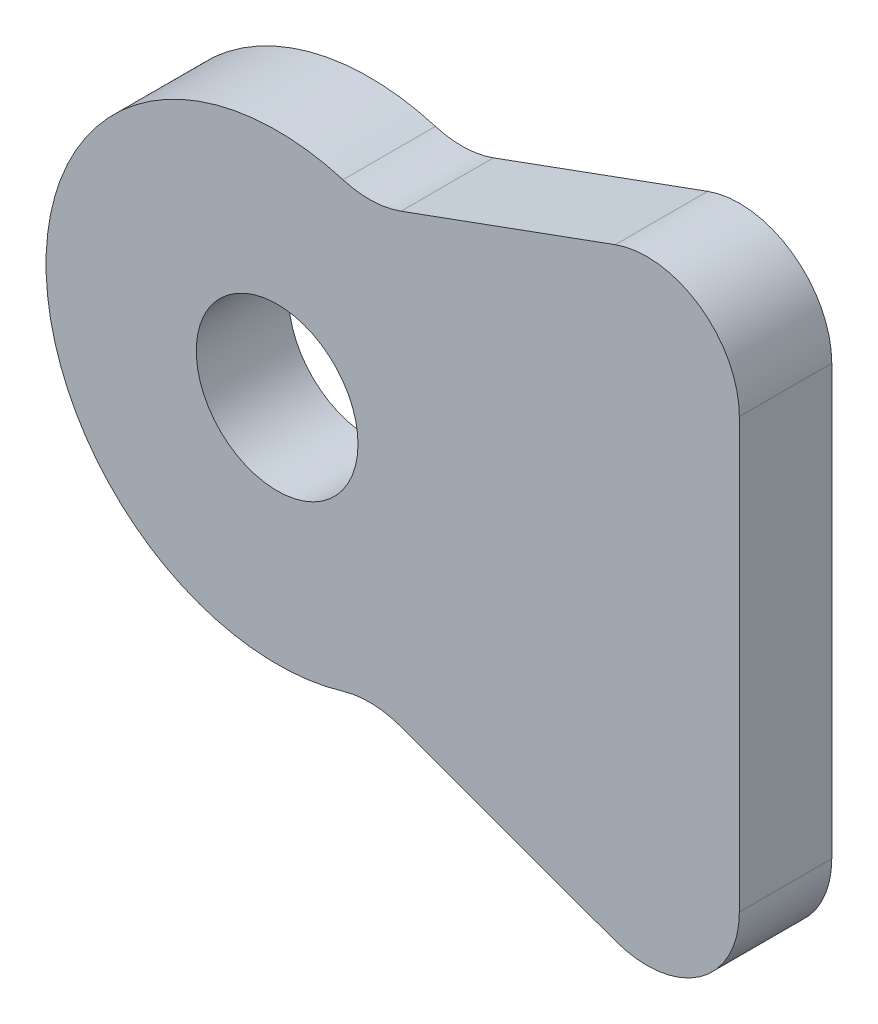
ISO-10303-21;
HEADER;
FILE_DESCRIPTION(('STEP AP214'),'2;1');
FILE_NAME('part.step','',(''),(''),'','','');
FILE_SCHEMA(('AUTOMOTIVE_DESIGN { 1 0 10303 214 1 1 1 1 }'));
ENDSEC;
DATA;
#1=APPLICATION_CONTEXT('core data for automotive mechanical design processes');
#2=APPLICATION_PROTOCOL_DEFINITION('international standard','automotive_design',2000,#1);
#3=PRODUCT_CONTEXT('',#1,'mechanical');
#4=PRODUCT('Part','Part','',(#3));
#5=PRODUCT_RELATED_PRODUCT_CATEGORY('part','',(#4));
#6=PRODUCT_DEFINITION_FORMATION('','',#4);
#7=PRODUCT_DEFINITION_CONTEXT('part definition',#1,'design');
#8=PRODUCT_DEFINITION('design','',#6,#7);
#9=PRODUCT_DEFINITION_SHAPE('','',#8);
#10=(LENGTH_UNIT() NAMED_UNIT(*) SI_UNIT(.MILLI.,.METRE.));
#11=(NAMED_UNIT(*) PLANE_ANGLE_UNIT() SI_UNIT($,.RADIAN.));
#12=(NAMED_UNIT(*) SI_UNIT($,.STERADIAN.) SOLID_ANGLE_UNIT());
#13=UNCERTAINTY_MEASURE_WITH_UNIT(LENGTH_MEASURE(1.E-05),#10,'distance_accuracy_value','');
#14=(GEOMETRIC_REPRESENTATION_CONTEXT(3) GLOBAL_UNCERTAINTY_ASSIGNED_CONTEXT((#13)) GLOBAL_UNIT_ASSIGNED_CONTEXT((#10,
#11,#12)) REPRESENTATION_CONTEXT('',''));
#15=CARTESIAN_POINT('',(0.,0.,0.));
#16=DIRECTION('',(0.,0.,1.));
#17=DIRECTION('',(1.,0.,0.));
#18=AXIS2_PLACEMENT_3D('',#15,#16,#17);
#19=CARTESIAN_POINT('',(0.,0.,2.));
#20=DIRECTION('',(0.,0.,1.));
#21=DIRECTION('',(1.,0.,0.));
#22=AXIS2_PLACEMENT_3D('',#19,#20,#21);
#23=PLANE('',#22);
#24=DIRECTION('',(0.939478721163946,-0.342607256899437,0.));
#25=VECTOR('',#24,1.);
#26=CARTESIAN_POINT('',(10.,-7.5,2.));
#27=LINE('',#26,#25);
#28=CARTESIAN_POINT('',(2.6803658446033,-4.83069017637678,2.));
#29=VERTEX_POINT('',#28);
#30=CARTESIAN_POINT('',(7.31478548620112,-6.52076123914823,2.));
#31=VERTEX_POINT('',#30);
#32=EDGE_CURVE('E159',#29,#31,#27,.T.);
#33=ORIENTED_EDGE('',*,*,#32,.T.);
#34=CARTESIAN_POINT('',(8.,-4.64180379682034,2.));
#35=DIRECTION('',(0.,0.,1.));
#36=DIRECTION('',(1.,0.,0.));
#37=AXIS2_PLACEMENT_3D('',#34,#35,#36);
#38=CIRCLE('',#37,2.);
#39=CARTESIAN_POINT('',(10.,-4.64180379682034,2.));
#40=VERTEX_POINT('',#39);
#41=EDGE_CURVE('E137',#31,#40,#38,.T.);
#42=ORIENTED_EDGE('',*,*,#41,.T.);
#43=DIRECTION('',(0.,1.,0.));
#44=VECTOR('',#43,1.);
#45=CARTESIAN_POINT('',(10.,7.5,2.));
#46=LINE('',#45,#44);
#47=CARTESIAN_POINT('',(10.,4.64180379682034,2.));
#48=VERTEX_POINT('',#47);
#49=EDGE_CURVE('E163',#40,#48,#46,.T.);
#50=ORIENTED_EDGE('',*,*,#49,.T.);
#51=CARTESIAN_POINT('',(8.,4.64180379682034,2.));
#52=DIRECTION('',(0.,0.,1.));
#53=DIRECTION('',(1.,0.,0.));
#54=AXIS2_PLACEMENT_3D('',#51,#52,#53);
#55=CIRCLE('',#54,2.);
#56=CARTESIAN_POINT('',(7.31478548620112,6.52076123914823,2.));
#57=VERTEX_POINT('',#56);
#58=EDGE_CURVE('E135',#48,#57,#55,.T.);
#59=ORIENTED_EDGE('',*,*,#58,.T.);
#60=DIRECTION('',(-0.939478721163946,-0.342607256899437,0.));
#61=VECTOR('',#60,1.);
#62=CARTESIAN_POINT('',(10.,7.5,2.));
#63=LINE('',#62,#61);
#64=CARTESIAN_POINT('',(2.6803658446033,4.83069017637678,2.));
#65=VERTEX_POINT('',#64);
#66=EDGE_CURVE('E104',#57,#65,#63,.T.);
#67=ORIENTED_EDGE('',*,*,#66,.T.);
#68=CARTESIAN_POINT('',(1.99515133080442,6.70964761870468,2.));
#69=DIRECTION('',(0.,0.,1.));
#70=DIRECTION('',(1.,0.,0.));
#71=AXIS2_PLACEMENT_3D('',#68,#69,#70);
#72=CIRCLE('',#71,2.);
#73=CARTESIAN_POINT('',(1.42510809343173,4.79260544193191,2.));
#74=VERTEX_POINT('',#73);
#75=EDGE_CURVE('E41',#65,#74,#72,.F.);
#76=ORIENTED_EDGE('',*,*,#75,.T.);
#77=CARTESIAN_POINT('',(0.,0.,2.));
#78=DIRECTION('',(0.,0.,1.));
#79=DIRECTION('',(1.,0.,0.));
#80=AXIS2_PLACEMENT_3D('',#77,#78,#79);
#81=CIRCLE('',#80,5.);
#82=CARTESIAN_POINT('',(1.42510809343173,-4.79260544193191,2.));
#83=VERTEX_POINT('',#82);
#84=EDGE_CURVE('E102',#74,#83,#81,.T.);
#85=ORIENTED_EDGE('',*,*,#84,.T.);
#86=CARTESIAN_POINT('',(1.99515133080442,-6.70964761870468,2.));
#87=DIRECTION('',(0.,0.,1.));
#88=DIRECTION('',(1.,0.,0.));
#89=AXIS2_PLACEMENT_3D('',#86,#87,#88);
#90=CIRCLE('',#89,2.);
#91=EDGE_CURVE('E146',#83,#29,#90,.F.);
#92=ORIENTED_EDGE('',*,*,#91,.T.);
#93=EDGE_LOOP('',(#33,#42,#50,#59,#67,#76,#85,#92));
#94=FACE_BOUND('',#93,.T.);
#95=CARTESIAN_POINT('',(0.,0.,2.));
#96=DIRECTION('',(0.,0.,1.));
#97=DIRECTION('',(1.,0.,0.));
#98=AXIS2_PLACEMENT_3D('',#95,#96,#97);
#99=CIRCLE('',#98,1.75);
#100=CARTESIAN_POINT('',(1.75,0.,2.));
#101=VERTEX_POINT('',#100);
#102=EDGE_CURVE('E156',#101,#101,#99,.T.);
#103=ORIENTED_EDGE('',*,*,#102,.F.);
#104=EDGE_LOOP('',(#103));
#105=FACE_BOUND('',#104,.T.);
#106=ADVANCED_FACE('F33',(#94,#105),#23,.T.);
#107=CARTESIAN_POINT('',(0.,0.,0.));
#108=DIRECTION('',(0.,0.,1.));
#109=DIRECTION('',(1.,0.,0.));
#110=AXIS2_PLACEMENT_3D('',#107,#108,#109);
#111=PLANE('',#110);
#112=DIRECTION('',(0.,1.,0.));
#113=VECTOR('',#112,1.);
#114=CARTESIAN_POINT('',(10.,7.5,0.));
#115=LINE('',#114,#113);
#116=CARTESIAN_POINT('',(10.,-4.64180379682034,0.));
#117=VERTEX_POINT('',#116);
#118=CARTESIAN_POINT('',(10.,4.64180379682034,0.));
#119=VERTEX_POINT('',#118);
#120=EDGE_CURVE('E175',#117,#119,#115,.T.);
#121=ORIENTED_EDGE('',*,*,#120,.F.);
#122=CARTESIAN_POINT('',(8.,-4.64180379682034,0.));
#123=DIRECTION('',(0.,0.,1.));
#124=DIRECTION('',(1.,0.,0.));
#125=AXIS2_PLACEMENT_3D('',#122,#123,#124);
#126=CIRCLE('',#125,2.);
#127=CARTESIAN_POINT('',(7.31478548620112,-6.52076123914823,0.));
#128=VERTEX_POINT('',#127);
#129=EDGE_CURVE('E144',#117,#128,#126,.F.);
#130=ORIENTED_EDGE('',*,*,#129,.T.);
#131=DIRECTION('',(0.939478721163946,-0.342607256899437,0.));
#132=VECTOR('',#131,1.);
#133=CARTESIAN_POINT('',(10.,-7.5,0.));
#134=LINE('',#133,#132);
#135=CARTESIAN_POINT('',(2.6803658446033,-4.83069017637678,0.));
#136=VERTEX_POINT('',#135);
#137=EDGE_CURVE('E153',#136,#128,#134,.T.);
#138=ORIENTED_EDGE('',*,*,#137,.F.);
#139=CARTESIAN_POINT('',(1.99515133080442,-6.70964761870468,0.));
#140=DIRECTION('',(0.,0.,1.));
#141=DIRECTION('',(1.,0.,0.));
#142=AXIS2_PLACEMENT_3D('',#139,#140,#141);
#143=CIRCLE('',#142,2.);
#144=CARTESIAN_POINT('',(1.42510809343173,-4.79260544193191,0.));
#145=VERTEX_POINT('',#144);
#146=EDGE_CURVE('E109',#136,#145,#143,.T.);
#147=ORIENTED_EDGE('',*,*,#146,.T.);
#148=CARTESIAN_POINT('',(0.,0.,0.));
#149=DIRECTION('',(0.,0.,1.));
#150=DIRECTION('',(1.,0.,0.));
#151=AXIS2_PLACEMENT_3D('',#148,#149,#150);
#152=CIRCLE('',#151,5.);
#153=CARTESIAN_POINT('',(1.42510809343173,4.79260544193191,0.));
#154=VERTEX_POINT('',#153);
#155=EDGE_CURVE('E118',#154,#145,#152,.T.);
#156=ORIENTED_EDGE('',*,*,#155,.F.);
#157=CARTESIAN_POINT('',(1.99515133080442,6.70964761870468,0.));
#158=DIRECTION('',(0.,0.,1.));
#159=DIRECTION('',(1.,0.,0.));
#160=AXIS2_PLACEMENT_3D('',#157,#158,#159);
#161=CIRCLE('',#160,2.);
#162=CARTESIAN_POINT('',(2.6803658446033,4.83069017637678,0.));
#163=VERTEX_POINT('',#162);
#164=EDGE_CURVE('E11',#154,#163,#161,.T.);
#165=ORIENTED_EDGE('',*,*,#164,.T.);
#166=DIRECTION('',(-0.939478721163946,-0.342607256899437,0.));
#167=VECTOR('',#166,1.);
#168=CARTESIAN_POINT('',(10.,7.5,0.));
#169=LINE('',#168,#167);
#170=CARTESIAN_POINT('',(7.31478548620112,6.52076123914823,0.));
#171=VERTEX_POINT('',#170);
#172=EDGE_CURVE('E166',#171,#163,#169,.T.);
#173=ORIENTED_EDGE('',*,*,#172,.F.);
#174=CARTESIAN_POINT('',(8.,4.64180379682034,0.));
#175=DIRECTION('',(0.,0.,1.));
#176=DIRECTION('',(1.,0.,0.));
#177=AXIS2_PLACEMENT_3D('',#174,#175,#176);
#178=CIRCLE('',#177,2.);
#179=EDGE_CURVE('E48',#171,#119,#178,.F.);
#180=ORIENTED_EDGE('',*,*,#179,.T.);
#181=EDGE_LOOP('',(#121,#130,#138,#147,#156,#165,#173,#180));
#182=FACE_BOUND('',#181,.T.);
#183=CARTESIAN_POINT('',(0.,0.,0.));
#184=DIRECTION('',(0.,0.,1.));
#185=DIRECTION('',(1.,0.,0.));
#186=AXIS2_PLACEMENT_3D('',#183,#184,#185);
#187=CIRCLE('',#186,1.75);
#188=CARTESIAN_POINT('',(1.75,0.,0.));
#189=VERTEX_POINT('',#188);
#190=EDGE_CURVE('E173',#189,#189,#187,.T.);
#191=ORIENTED_EDGE('',*,*,#190,.T.);
#192=EDGE_LOOP('',(#191));
#193=FACE_BOUND('',#192,.T.);
#194=ADVANCED_FACE('F150',(#182,#193),#111,.F.);
#195=CARTESIAN_POINT('',(0.,0.,2.));
#196=DIRECTION('',(0.,0.,-1.));
#197=DIRECTION('',(-1.,0.,0.));
#198=AXIS2_PLACEMENT_3D('',#195,#196,#197);
#199=CYLINDRICAL_SURFACE('',#198,5.);
#200=ORIENTED_EDGE('',*,*,#155,.T.);
#201=DIRECTION('',(0.,0.,-1.));
#202=VECTOR('',#201,1.);
#203=CARTESIAN_POINT('',(1.42510809343173,-4.79260544193191,2.));
#204=LINE('',#203,#202);
#205=EDGE_CURVE('E117',#145,#83,#204,.F.);
#206=ORIENTED_EDGE('',*,*,#205,.T.);
#207=ORIENTED_EDGE('',*,*,#84,.F.);
#208=DIRECTION('',(0.,0.,-1.));
#209=VECTOR('',#208,1.);
#210=CARTESIAN_POINT('',(1.42510809343173,4.79260544193191,2.));
#211=LINE('',#210,#209);
#212=EDGE_CURVE('E114',#74,#154,#211,.T.);
#213=ORIENTED_EDGE('',*,*,#212,.T.);
#214=EDGE_LOOP('',(#200,#206,#207,#213));
#215=FACE_BOUND('',#214,.T.);
#216=ADVANCED_FACE('F113',(#215),#199,.T.);
#217=CARTESIAN_POINT('',(0.,0.,2.));
#218=DIRECTION('',(0.,0.,-1.));
#219=DIRECTION('',(-1.,0.,0.));
#220=AXIS2_PLACEMENT_3D('',#217,#218,#219);
#221=CYLINDRICAL_SURFACE('',#220,1.75);
#222=ORIENTED_EDGE('',*,*,#102,.T.);
#223=EDGE_LOOP('',(#222));
#224=FACE_BOUND('',#223,.T.);
#225=ORIENTED_EDGE('',*,*,#190,.F.);
#226=EDGE_LOOP('',(#225));
#227=FACE_BOUND('',#226,.T.);
#228=ADVANCED_FACE('F202',(#224,#227),#221,.F.);
#229=CARTESIAN_POINT('',(10.,7.5,0.));
#230=DIRECTION('',(-0.342607256899437,0.939478721163946,0.));
#231=DIRECTION('',(-0.939478721163946,-0.342607256899437,0.));
#232=AXIS2_PLACEMENT_3D('',#229,#230,#231);
#233=PLANE('',#232);
#234=ORIENTED_EDGE('',*,*,#172,.T.);
#235=DIRECTION('',(0.,0.,-1.));
#236=VECTOR('',#235,1.);
#237=CARTESIAN_POINT('',(2.6803658446033,4.83069017637678,0.));
#238=LINE('',#237,#236);
#239=EDGE_CURVE('E133',#163,#65,#238,.F.);
#240=ORIENTED_EDGE('',*,*,#239,.T.);
#241=ORIENTED_EDGE('',*,*,#66,.F.);
#242=DIRECTION('',(0.,0.,1.));
#243=VECTOR('',#242,1.);
#244=CARTESIAN_POINT('',(7.31478548620113,6.52076123914823,0.));
#245=LINE('',#244,#243);
#246=EDGE_CURVE('E131',#57,#171,#245,.F.);
#247=ORIENTED_EDGE('',*,*,#246,.T.);
#248=EDGE_LOOP('',(#234,#240,#241,#247));
#249=FACE_BOUND('',#248,.T.);
#250=ADVANCED_FACE('F182',(#249),#233,.T.);
#251=CARTESIAN_POINT('',(10.,7.5,0.));
#252=DIRECTION('',(1.,0.,0.));
#253=DIRECTION('',(0.,0.,-1.));
#254=AXIS2_PLACEMENT_3D('',#251,#252,#253);
#255=PLANE('',#254);
#256=ORIENTED_EDGE('',*,*,#49,.F.);
#257=DIRECTION('',(0.,0.,1.));
#258=VECTOR('',#257,1.);
#259=CARTESIAN_POINT('',(10.,-4.64180379682034,0.));
#260=LINE('',#259,#258);
#261=EDGE_CURVE('E55',#40,#117,#260,.F.);
#262=ORIENTED_EDGE('',*,*,#261,.T.);
#263=ORIENTED_EDGE('',*,*,#120,.T.);
#264=DIRECTION('',(0.,0.,1.));
#265=VECTOR('',#264,1.);
#266=CARTESIAN_POINT('',(10.,4.64180379682034,0.));
#267=LINE('',#266,#265);
#268=EDGE_CURVE('E139',#119,#48,#267,.T.);
#269=ORIENTED_EDGE('',*,*,#268,.T.);
#270=EDGE_LOOP('',(#256,#262,#263,#269));
#271=FACE_BOUND('',#270,.T.);
#272=ADVANCED_FACE('F185',(#271),#255,.T.);
#273=CARTESIAN_POINT('',(10.,-7.5,0.));
#274=DIRECTION('',(-0.342607256899437,-0.939478721163946,0.));
#275=DIRECTION('',(0.939478721163946,-0.342607256899437,0.));
#276=AXIS2_PLACEMENT_3D('',#273,#274,#275);
#277=PLANE('',#276);
#278=ORIENTED_EDGE('',*,*,#32,.F.);
#279=DIRECTION('',(0.,0.,-1.));
#280=VECTOR('',#279,1.);
#281=CARTESIAN_POINT('',(2.6803658446033,-4.83069017637678,0.));
#282=LINE('',#281,#280);
#283=EDGE_CURVE('E129',#29,#136,#282,.T.);
#284=ORIENTED_EDGE('',*,*,#283,.T.);
#285=ORIENTED_EDGE('',*,*,#137,.T.);
#286=DIRECTION('',(0.,0.,1.));
#287=VECTOR('',#286,1.);
#288=CARTESIAN_POINT('',(7.31478548620113,-6.52076123914823,0.));
#289=LINE('',#288,#287);
#290=EDGE_CURVE('E123',#128,#31,#289,.T.);
#291=ORIENTED_EDGE('',*,*,#290,.T.);
#292=EDGE_LOOP('',(#278,#284,#285,#291));
#293=FACE_BOUND('',#292,.T.);
#294=ADVANCED_FACE('F161',(#293),#277,.T.);
#295=CARTESIAN_POINT('',(1.99515133080442,-6.70964761870468,2.));
#296=DIRECTION('',(0.,0.,-1.));
#297=DIRECTION('',(-1.,0.,0.));
#298=AXIS2_PLACEMENT_3D('',#295,#296,#297);
#299=CYLINDRICAL_SURFACE('',#298,2.);
#300=ORIENTED_EDGE('',*,*,#146,.F.);
#301=ORIENTED_EDGE('',*,*,#283,.F.);
#302=ORIENTED_EDGE('',*,*,#91,.F.);
#303=ORIENTED_EDGE('',*,*,#205,.F.);
#304=EDGE_LOOP('',(#300,#301,#302,#303));
#305=FACE_BOUND('',#304,.T.);
#306=ADVANCED_FACE('F157',(#305),#299,.F.);
#307=CARTESIAN_POINT('',(1.99515133080442,6.70964761870468,2.));
#308=DIRECTION('',(0.,0.,-1.));
#309=DIRECTION('',(-1.,0.,0.));
#310=AXIS2_PLACEMENT_3D('',#307,#308,#309);
#311=CYLINDRICAL_SURFACE('',#310,2.);
#312=ORIENTED_EDGE('',*,*,#164,.F.);
#313=ORIENTED_EDGE('',*,*,#212,.F.);
#314=ORIENTED_EDGE('',*,*,#75,.F.);
#315=ORIENTED_EDGE('',*,*,#239,.F.);
#316=EDGE_LOOP('',(#312,#313,#314,#315));
#317=FACE_BOUND('',#316,.T.);
#318=ADVANCED_FACE('F121',(#317),#311,.F.);
#319=CARTESIAN_POINT('',(8.,-4.64180379682034,0.));
#320=DIRECTION('',(0.,0.,1.));
#321=DIRECTION('',(1.,0.,0.));
#322=AXIS2_PLACEMENT_3D('',#319,#320,#321);
#323=CYLINDRICAL_SURFACE('',#322,2.);
#324=ORIENTED_EDGE('',*,*,#129,.F.);
#325=ORIENTED_EDGE('',*,*,#261,.F.);
#326=ORIENTED_EDGE('',*,*,#41,.F.);
#327=ORIENTED_EDGE('',*,*,#290,.F.);
#328=EDGE_LOOP('',(#324,#325,#326,#327));
#329=FACE_BOUND('',#328,.T.);
#330=ADVANCED_FACE('F188',(#329),#323,.T.);
#331=CARTESIAN_POINT('',(8.,4.64180379682034,0.));
#332=DIRECTION('',(0.,0.,1.));
#333=DIRECTION('',(1.,0.,0.));
#334=AXIS2_PLACEMENT_3D('',#331,#332,#333);
#335=CYLINDRICAL_SURFACE('',#334,2.);
#336=ORIENTED_EDGE('',*,*,#179,.F.);
#337=ORIENTED_EDGE('',*,*,#246,.F.);
#338=ORIENTED_EDGE('',*,*,#58,.F.);
#339=ORIENTED_EDGE('',*,*,#268,.F.);
#340=EDGE_LOOP('',(#336,#337,#338,#339));
#341=FACE_BOUND('',#340,.T.);
#342=ADVANCED_FACE('F35',(#341),#335,.T.);
#343=CLOSED_SHELL('',(#106,#194,#216,#228,#250,#272,#294,#306,#318,#330,#342));
#344=MANIFOLD_SOLID_BREP('B2',#343);
#345=ADVANCED_BREP_SHAPE_REPRESENTATION('',(#18,#344),#14);
#346=SHAPE_DEFINITION_REPRESENTATION(#9,#345);
ENDSEC;
END-ISO-10303-21;
